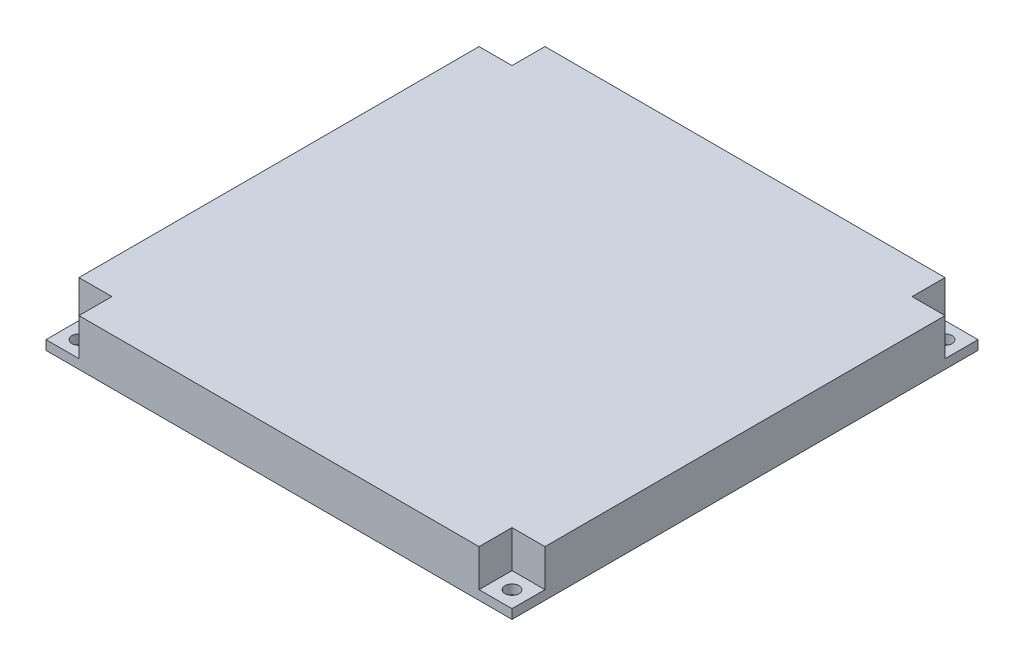
ISO-10303-21;
HEADER;
FILE_DESCRIPTION(('STEP AP214'),'2;1');
FILE_NAME('part.step','',(''),(''),'','','');
FILE_SCHEMA(('AUTOMOTIVE_DESIGN { 1 0 10303 214 1 1 1 1 }'));
ENDSEC;
DATA;
#1=APPLICATION_CONTEXT('core data for automotive mechanical design processes');
#2=APPLICATION_PROTOCOL_DEFINITION('international standard','automotive_design',2000,#1);
#3=PRODUCT_CONTEXT('',#1,'mechanical');
#4=PRODUCT('Part','Part','',(#3));
#5=PRODUCT_RELATED_PRODUCT_CATEGORY('part','',(#4));
#6=PRODUCT_DEFINITION_FORMATION('','',#4);
#7=PRODUCT_DEFINITION_CONTEXT('part definition',#1,'design');
#8=PRODUCT_DEFINITION('design','',#6,#7);
#9=PRODUCT_DEFINITION_SHAPE('','',#8);
#10=(LENGTH_UNIT() NAMED_UNIT(*) SI_UNIT(.MILLI.,.METRE.));
#11=(NAMED_UNIT(*) PLANE_ANGLE_UNIT() SI_UNIT($,.RADIAN.));
#12=(NAMED_UNIT(*) SI_UNIT($,.STERADIAN.) SOLID_ANGLE_UNIT());
#13=UNCERTAINTY_MEASURE_WITH_UNIT(LENGTH_MEASURE(1.E-05),#10,'distance_accuracy_value','');
#14=(GEOMETRIC_REPRESENTATION_CONTEXT(3) GLOBAL_UNCERTAINTY_ASSIGNED_CONTEXT((#13)) GLOBAL_UNIT_ASSIGNED_CONTEXT((#10,
#11,#12)) REPRESENTATION_CONTEXT('',''));
#15=CARTESIAN_POINT('',(0.,0.,0.));
#16=DIRECTION('',(0.,0.,1.));
#17=DIRECTION('',(1.,0.,0.));
#18=AXIS2_PLACEMENT_3D('',#15,#16,#17);
#19=CARTESIAN_POINT('',(-46.4644660940671,-20.,-46.4644660940674));
#20=DIRECTION('',(0.,1.,0.));
#21=DIRECTION('',(0.,0.,1.));
#22=AXIS2_PLACEMENT_3D('',#19,#20,#21);
#23=CYLINDRICAL_SURFACE('',#22,1.5);
#24=CARTESIAN_POINT('',(-46.4644660940671,0.,-46.4644660940674));
#25=DIRECTION('',(0.,1.,0.));
#26=DIRECTION('',(0.,0.,1.));
#27=AXIS2_PLACEMENT_3D('',#24,#25,#26);
#28=CIRCLE('',#27,1.5);
#29=CARTESIAN_POINT('',(-46.4644660940671,0.,-44.9644660940674));
#30=VERTEX_POINT('',#29);
#31=EDGE_CURVE('E391',#30,#30,#28,.T.);
#32=ORIENTED_EDGE('',*,*,#31,.F.);
#33=EDGE_LOOP('',(#32));
#34=FACE_BOUND('',#33,.T.);
#35=CARTESIAN_POINT('',(-46.4644660940671,2.,-46.4644660940674));
#36=DIRECTION('',(0.,1.,0.));
#37=DIRECTION('',(0.,0.,1.));
#38=AXIS2_PLACEMENT_3D('',#35,#36,#37);
#39=CIRCLE('',#38,1.5);
#40=CARTESIAN_POINT('',(-46.4644660940671,2.,-44.9644660940674));
#41=VERTEX_POINT('',#40);
#42=EDGE_CURVE('E403',#41,#41,#39,.F.);
#43=ORIENTED_EDGE('',*,*,#42,.F.);
#44=EDGE_LOOP('',(#43));
#45=FACE_BOUND('',#44,.T.);
#46=ADVANCED_FACE('F42',(#34,#45),#23,.F.);
#47=CARTESIAN_POINT('',(46.4644660940676,-20.,-46.4644660940669));
#48=DIRECTION('',(0.,1.,0.));
#49=DIRECTION('',(0.,0.,1.));
#50=AXIS2_PLACEMENT_3D('',#47,#48,#49);
#51=CYLINDRICAL_SURFACE('',#50,1.50000000000001);
#52=CARTESIAN_POINT('',(46.4644660940676,0.,-46.4644660940669));
#53=DIRECTION('',(0.,1.,0.));
#54=DIRECTION('',(0.,0.,1.));
#55=AXIS2_PLACEMENT_3D('',#52,#53,#54);
#56=CIRCLE('',#55,1.50000000000001);
#57=CARTESIAN_POINT('',(46.4644660940676,0.,-44.9644660940669));
#58=VERTEX_POINT('',#57);
#59=EDGE_CURVE('E394',#58,#58,#56,.T.);
#60=ORIENTED_EDGE('',*,*,#59,.F.);
#61=EDGE_LOOP('',(#60));
#62=FACE_BOUND('',#61,.T.);
#63=CARTESIAN_POINT('',(46.4644660940676,2.,-46.4644660940669));
#64=DIRECTION('',(0.,1.,0.));
#65=DIRECTION('',(0.,0.,1.));
#66=AXIS2_PLACEMENT_3D('',#63,#64,#65);
#67=CIRCLE('',#66,1.50000000000001);
#68=CARTESIAN_POINT('',(46.4644660940676,2.,-44.9644660940669));
#69=VERTEX_POINT('',#68);
#70=EDGE_CURVE('E401',#69,#69,#67,.F.);
#71=ORIENTED_EDGE('',*,*,#70,.F.);
#72=EDGE_LOOP('',(#71));
#73=FACE_BOUND('',#72,.T.);
#74=ADVANCED_FACE('F431',(#62,#73),#51,.F.);
#75=CARTESIAN_POINT('',(46.4644660940668,-20.,46.4644660940677));
#76=DIRECTION('',(0.,1.,0.));
#77=DIRECTION('',(0.,0.,1.));
#78=AXIS2_PLACEMENT_3D('',#75,#76,#77);
#79=CYLINDRICAL_SURFACE('',#78,1.50000000000001);
#80=CARTESIAN_POINT('',(46.4644660940668,0.,46.4644660940677));
#81=DIRECTION('',(0.,1.,0.));
#82=DIRECTION('',(0.,0.,1.));
#83=AXIS2_PLACEMENT_3D('',#80,#81,#82);
#84=CIRCLE('',#83,1.50000000000001);
#85=CARTESIAN_POINT('',(46.4644660940668,0.,47.9644660940677));
#86=VERTEX_POINT('',#85);
#87=EDGE_CURVE('E376',#86,#86,#84,.T.);
#88=ORIENTED_EDGE('',*,*,#87,.F.);
#89=EDGE_LOOP('',(#88));
#90=FACE_BOUND('',#89,.T.);
#91=CARTESIAN_POINT('',(46.4644660940668,2.,46.4644660940677));
#92=DIRECTION('',(0.,1.,0.));
#93=DIRECTION('',(0.,0.,1.));
#94=AXIS2_PLACEMENT_3D('',#91,#92,#93);
#95=CIRCLE('',#94,1.50000000000001);
#96=CARTESIAN_POINT('',(46.4644660940668,2.,47.9644660940677));
#97=VERTEX_POINT('',#96);
#98=EDGE_CURVE('E354',#97,#97,#95,.F.);
#99=ORIENTED_EDGE('',*,*,#98,.F.);
#100=EDGE_LOOP('',(#99));
#101=FACE_BOUND('',#100,.T.);
#102=ADVANCED_FACE('F437',(#90,#101),#79,.F.);
#103=CARTESIAN_POINT('',(50.,10.,-50.));
#104=DIRECTION('',(-1.,0.,0.));
#105=DIRECTION('',(0.,0.,1.));
#106=AXIS2_PLACEMENT_3D('',#103,#104,#105);
#107=PLANE('',#106);
#108=DIRECTION('',(0.,0.,-1.));
#109=VECTOR('',#108,1.);
#110=CARTESIAN_POINT('',(50.,10.,-50.));
#111=LINE('',#110,#109);
#112=CARTESIAN_POINT('',(50.,10.,42.928932188135));
#113=VERTEX_POINT('',#112);
#114=CARTESIAN_POINT('',(50.0000000000003,10.,-42.9289321881342));
#115=VERTEX_POINT('',#114);
#116=EDGE_CURVE('E358',#113,#115,#111,.T.);
#117=ORIENTED_EDGE('',*,*,#116,.F.);
#118=DIRECTION('',(0.,1.,0.));
#119=VECTOR('',#118,1.);
#120=CARTESIAN_POINT('',(49.9999999999995,2.,42.928932188135));
#121=LINE('',#120,#119);
#122=CARTESIAN_POINT('',(49.9999999999995,2.,42.928932188135));
#123=VERTEX_POINT('',#122);
#124=EDGE_CURVE('E316',#123,#113,#121,.T.);
#125=ORIENTED_EDGE('',*,*,#124,.F.);
#126=DIRECTION('',(0.,0.,-1.));
#127=VECTOR('',#126,1.);
#128=CARTESIAN_POINT('',(49.9999999999995,2.,42.928932188135));
#129=LINE('',#128,#127);
#130=CARTESIAN_POINT('',(49.9999999999995,2.,50.0000000000005));
#131=VERTEX_POINT('',#130);
#132=EDGE_CURVE('E325',#131,#123,#129,.T.);
#133=ORIENTED_EDGE('',*,*,#132,.F.);
#134=DIRECTION('',(0.,-1.,0.));
#135=VECTOR('',#134,1.);
#136=CARTESIAN_POINT('',(50.,10.,50.));
#137=LINE('',#136,#135);
#138=CARTESIAN_POINT('',(50.,0.,50.));
#139=VERTEX_POINT('',#138);
#140=EDGE_CURVE('E371',#131,#139,#137,.T.);
#141=ORIENTED_EDGE('',*,*,#140,.T.);
#142=DIRECTION('',(0.,0.,-1.));
#143=VECTOR('',#142,1.);
#144=CARTESIAN_POINT('',(50.,0.,-50.));
#145=LINE('',#144,#143);
#146=CARTESIAN_POINT('',(50.,0.,-50.));
#147=VERTEX_POINT('',#146);
#148=EDGE_CURVE('E372',#139,#147,#145,.T.);
#149=ORIENTED_EDGE('',*,*,#148,.T.);
#150=DIRECTION('',(0.,-1.,0.));
#151=VECTOR('',#150,1.);
#152=CARTESIAN_POINT('',(50.,10.,-50.));
#153=LINE('',#152,#151);
#154=CARTESIAN_POINT('',(50.0000000000003,2.,-49.9999999999996));
#155=VERTEX_POINT('',#154);
#156=EDGE_CURVE('E11',#155,#147,#153,.T.);
#157=ORIENTED_EDGE('',*,*,#156,.F.);
#158=DIRECTION('',(0.,0.,-1.));
#159=VECTOR('',#158,1.);
#160=CARTESIAN_POINT('',(50.0000000000003,2.,-42.9289321881342));
#161=LINE('',#160,#159);
#162=CARTESIAN_POINT('',(50.0000000000003,2.,-42.9289321881342));
#163=VERTEX_POINT('',#162);
#164=EDGE_CURVE('E295',#163,#155,#161,.T.);
#165=ORIENTED_EDGE('',*,*,#164,.F.);
#166=DIRECTION('',(0.,1.,0.));
#167=VECTOR('',#166,1.);
#168=CARTESIAN_POINT('',(50.0000000000003,2.,-42.9289321881342));
#169=LINE('',#168,#167);
#170=EDGE_CURVE('E298',#163,#115,#169,.T.);
#171=ORIENTED_EDGE('',*,*,#170,.T.);
#172=EDGE_LOOP('',(#117,#125,#133,#141,#149,#157,#165,#171));
#173=FACE_BOUND('',#172,.T.);
#174=ADVANCED_FACE('F44',(#173),#107,.F.);
#175=CARTESIAN_POINT('',(-50.,10.,-50.));
#176=DIRECTION('',(0.,0.,1.));
#177=DIRECTION('',(1.,0.,0.));
#178=AXIS2_PLACEMENT_3D('',#175,#176,#177);
#179=PLANE('',#178);
#180=DIRECTION('',(-1.,0.,0.));
#181=VECTOR('',#180,1.);
#182=CARTESIAN_POINT('',(-50.,10.,-50.));
#183=LINE('',#182,#181);
#184=CARTESIAN_POINT('',(42.9289321881348,10.,-50.));
#185=VERTEX_POINT('',#184);
#186=CARTESIAN_POINT('',(-42.9289321881343,10.,-50.0000000000001));
#187=VERTEX_POINT('',#186);
#188=EDGE_CURVE('E361',#185,#187,#183,.T.);
#189=ORIENTED_EDGE('',*,*,#188,.F.);
#190=DIRECTION('',(0.,1.,0.));
#191=VECTOR('',#190,1.);
#192=CARTESIAN_POINT('',(42.9289321881348,2.,-49.9999999999997));
#193=LINE('',#192,#191);
#194=CARTESIAN_POINT('',(42.9289321881348,2.,-49.9999999999997));
#195=VERTEX_POINT('',#194);
#196=EDGE_CURVE('E293',#195,#185,#193,.T.);
#197=ORIENTED_EDGE('',*,*,#196,.F.);
#198=DIRECTION('',(-1.,0.,0.));
#199=VECTOR('',#198,1.);
#200=CARTESIAN_POINT('',(42.9289321881348,2.,-49.9999999999997));
#201=LINE('',#200,#199);
#202=EDGE_CURVE('E304',#155,#195,#201,.T.);
#203=ORIENTED_EDGE('',*,*,#202,.F.);
#204=ORIENTED_EDGE('',*,*,#156,.T.);
#205=DIRECTION('',(-1.,0.,0.));
#206=VECTOR('',#205,1.);
#207=CARTESIAN_POINT('',(-50.,0.,-50.));
#208=LINE('',#207,#206);
#209=CARTESIAN_POINT('',(-50.,0.,-50.));
#210=VERTEX_POINT('',#209);
#211=EDGE_CURVE('E375',#147,#210,#208,.T.);
#212=ORIENTED_EDGE('',*,*,#211,.T.);
#213=DIRECTION('',(0.,-1.,0.));
#214=VECTOR('',#213,1.);
#215=CARTESIAN_POINT('',(-50.,10.,-50.));
#216=LINE('',#215,#214);
#217=CARTESIAN_POINT('',(-49.9999999999998,2.,-50.0000000000002));
#218=VERTEX_POINT('',#217);
#219=EDGE_CURVE('E51',#218,#210,#216,.T.);
#220=ORIENTED_EDGE('',*,*,#219,.F.);
#221=DIRECTION('',(-1.,0.,0.));
#222=VECTOR('',#221,1.);
#223=CARTESIAN_POINT('',(-42.9289321881343,2.,-50.0000000000001));
#224=LINE('',#223,#222);
#225=CARTESIAN_POINT('',(-42.9289321881343,2.,-50.0000000000001));
#226=VERTEX_POINT('',#225);
#227=EDGE_CURVE('E270',#226,#218,#224,.T.);
#228=ORIENTED_EDGE('',*,*,#227,.F.);
#229=DIRECTION('',(0.,1.,0.));
#230=VECTOR('',#229,1.);
#231=CARTESIAN_POINT('',(-42.9289321881343,2.,-50.0000000000001));
#232=LINE('',#231,#230);
#233=EDGE_CURVE('E273',#226,#187,#232,.T.);
#234=ORIENTED_EDGE('',*,*,#233,.T.);
#235=EDGE_LOOP('',(#189,#197,#203,#204,#212,#220,#228,#234));
#236=FACE_BOUND('',#235,.T.);
#237=ADVANCED_FACE('F462',(#236),#179,.F.);
#238=CARTESIAN_POINT('',(-50.,10.,-50.));
#239=DIRECTION('',(1.,0.,0.));
#240=DIRECTION('',(0.,0.,-1.));
#241=AXIS2_PLACEMENT_3D('',#238,#239,#240);
#242=PLANE('',#241);
#243=DIRECTION('',(0.,0.,1.));
#244=VECTOR('',#243,1.);
#245=CARTESIAN_POINT('',(-50.,10.,-50.));
#246=LINE('',#245,#244);
#247=CARTESIAN_POINT('',(-50.,10.,-42.9289321881347));
#248=VERTEX_POINT('',#247);
#249=CARTESIAN_POINT('',(-50.,10.,42.9289321881345));
#250=VERTEX_POINT('',#249);
#251=EDGE_CURVE('E365',#248,#250,#246,.T.);
#252=ORIENTED_EDGE('',*,*,#251,.F.);
#253=DIRECTION('',(0.,1.,0.));
#254=VECTOR('',#253,1.);
#255=CARTESIAN_POINT('',(-49.9999999999998,2.,-42.9289321881347));
#256=LINE('',#255,#254);
#257=CARTESIAN_POINT('',(-49.9999999999998,2.,-42.9289321881347));
#258=VERTEX_POINT('',#257);
#259=EDGE_CURVE('E268',#258,#248,#256,.T.);
#260=ORIENTED_EDGE('',*,*,#259,.F.);
#261=DIRECTION('',(0.,0.,1.));
#262=VECTOR('',#261,1.);
#263=CARTESIAN_POINT('',(-49.9999999999998,2.,-42.9289321881347));
#264=LINE('',#263,#262);
#265=EDGE_CURVE('E280',#218,#258,#264,.T.);
#266=ORIENTED_EDGE('',*,*,#265,.F.);
#267=ORIENTED_EDGE('',*,*,#219,.T.);
#268=DIRECTION('',(0.,0.,1.));
#269=VECTOR('',#268,1.);
#270=CARTESIAN_POINT('',(-50.,0.,-50.));
#271=LINE('',#270,#269);
#272=CARTESIAN_POINT('',(-50.,0.,50.));
#273=VERTEX_POINT('',#272);
#274=EDGE_CURVE('E379',#210,#273,#271,.T.);
#275=ORIENTED_EDGE('',*,*,#274,.T.);
#276=DIRECTION('',(0.,-1.,0.));
#277=VECTOR('',#276,1.);
#278=CARTESIAN_POINT('',(-50.,10.,50.));
#279=LINE('',#278,#277);
#280=CARTESIAN_POINT('',(-50.,2.,50.));
#281=VERTEX_POINT('',#280);
#282=EDGE_CURVE('E385',#281,#273,#279,.T.);
#283=ORIENTED_EDGE('',*,*,#282,.F.);
#284=DIRECTION('',(0.,0.,1.));
#285=VECTOR('',#284,1.);
#286=CARTESIAN_POINT('',(-50.,2.,42.9289321881345));
#287=LINE('',#286,#285);
#288=CARTESIAN_POINT('',(-50.,2.,42.9289321881345));
#289=VERTEX_POINT('',#288);
#290=EDGE_CURVE('E337',#289,#281,#287,.T.);
#291=ORIENTED_EDGE('',*,*,#290,.F.);
#292=DIRECTION('',(0.,1.,0.));
#293=VECTOR('',#292,1.);
#294=CARTESIAN_POINT('',(-50.,2.,42.9289321881345));
#295=LINE('',#294,#293);
#296=EDGE_CURVE('E351',#289,#250,#295,.T.);
#297=ORIENTED_EDGE('',*,*,#296,.T.);
#298=EDGE_LOOP('',(#252,#260,#266,#267,#275,#283,#291,#297));
#299=FACE_BOUND('',#298,.T.);
#300=ADVANCED_FACE('F459',(#299),#242,.F.);
#301=CARTESIAN_POINT('',(-50.,10.,50.));
#302=DIRECTION('',(0.,0.,-1.));
#303=DIRECTION('',(-1.,0.,0.));
#304=AXIS2_PLACEMENT_3D('',#301,#302,#303);
#305=PLANE('',#304);
#306=DIRECTION('',(1.,0.,0.));
#307=VECTOR('',#306,1.);
#308=CARTESIAN_POINT('',(42.928932188134,2.,50.0000000000004));
#309=LINE('',#308,#307);
#310=CARTESIAN_POINT('',(42.928932188134,2.,50.0000000000004));
#311=VERTEX_POINT('',#310);
#312=EDGE_CURVE('E318',#311,#131,#309,.T.);
#313=ORIENTED_EDGE('',*,*,#312,.F.);
#314=DIRECTION('',(0.,1.,0.));
#315=VECTOR('',#314,1.);
#316=CARTESIAN_POINT('',(42.928932188134,2.,50.0000000000004));
#317=LINE('',#316,#315);
#318=CARTESIAN_POINT('',(42.928932188134,10.,50.0000000000004));
#319=VERTEX_POINT('',#318);
#320=EDGE_CURVE('E267',#311,#319,#317,.T.);
#321=ORIENTED_EDGE('',*,*,#320,.T.);
#322=DIRECTION('',(1.,0.,0.));
#323=VECTOR('',#322,1.);
#324=CARTESIAN_POINT('',(-50.,10.,50.));
#325=LINE('',#324,#323);
#326=CARTESIAN_POINT('',(-42.9289321881345,10.,50.));
#327=VERTEX_POINT('',#326);
#328=EDGE_CURVE('E368',#327,#319,#325,.T.);
#329=ORIENTED_EDGE('',*,*,#328,.F.);
#330=DIRECTION('',(0.,1.,0.));
#331=VECTOR('',#330,1.);
#332=CARTESIAN_POINT('',(-42.9289321881345,2.,50.));
#333=LINE('',#332,#331);
#334=CARTESIAN_POINT('',(-42.9289321881345,2.,50.));
#335=VERTEX_POINT('',#334);
#336=EDGE_CURVE('E67',#335,#327,#333,.T.);
#337=ORIENTED_EDGE('',*,*,#336,.F.);
#338=DIRECTION('',(1.,0.,0.));
#339=VECTOR('',#338,1.);
#340=CARTESIAN_POINT('',(-42.9289321881345,2.,50.));
#341=LINE('',#340,#339);
#342=EDGE_CURVE('E339',#281,#335,#341,.T.);
#343=ORIENTED_EDGE('',*,*,#342,.F.);
#344=ORIENTED_EDGE('',*,*,#282,.T.);
#345=DIRECTION('',(1.,0.,0.));
#346=VECTOR('',#345,1.);
#347=CARTESIAN_POINT('',(-50.,0.,50.));
#348=LINE('',#347,#346);
#349=EDGE_CURVE('E362',#273,#139,#348,.T.);
#350=ORIENTED_EDGE('',*,*,#349,.T.);
#351=ORIENTED_EDGE('',*,*,#140,.F.);
#352=EDGE_LOOP('',(#313,#321,#329,#337,#343,#344,#350,#351));
#353=FACE_BOUND('',#352,.T.);
#354=ADVANCED_FACE('F453',(#353),#305,.F.);
#355=CARTESIAN_POINT('',(0.,10.,0.));
#356=DIRECTION('',(0.,1.,0.));
#357=DIRECTION('',(0.,0.,1.));
#358=AXIS2_PLACEMENT_3D('',#355,#356,#357);
#359=PLANE('',#358);
#360=DIRECTION('',(0.,0.,1.));
#361=VECTOR('',#360,1.);
#362=CARTESIAN_POINT('',(42.9289321881341,10.,42.928932188135));
#363=LINE('',#362,#361);
#364=CARTESIAN_POINT('',(42.9289321881341,10.,42.928932188135));
#365=VERTEX_POINT('',#364);
#366=EDGE_CURVE('E323',#365,#319,#363,.T.);
#367=ORIENTED_EDGE('',*,*,#366,.F.);
#368=DIRECTION('',(-1.,0.,0.));
#369=VECTOR('',#368,1.);
#370=CARTESIAN_POINT('',(42.9289321881341,10.,42.928932188135));
#371=LINE('',#370,#369);
#372=EDGE_CURVE('E301',#113,#365,#371,.T.);
#373=ORIENTED_EDGE('',*,*,#372,.F.);
#374=ORIENTED_EDGE('',*,*,#116,.T.);
#375=DIRECTION('',(1.,0.,0.));
#376=VECTOR('',#375,1.);
#377=CARTESIAN_POINT('',(42.9289321881348,10.,-42.9289321881342));
#378=LINE('',#377,#376);
#379=CARTESIAN_POINT('',(42.9289321881348,10.,-42.9289321881342));
#380=VERTEX_POINT('',#379);
#381=EDGE_CURVE('E302',#380,#115,#378,.T.);
#382=ORIENTED_EDGE('',*,*,#381,.F.);
#383=DIRECTION('',(0.,0.,1.));
#384=VECTOR('',#383,1.);
#385=CARTESIAN_POINT('',(42.9289321881348,10.,-42.9289321881342));
#386=LINE('',#385,#384);
#387=EDGE_CURVE('E276',#185,#380,#386,.T.);
#388=ORIENTED_EDGE('',*,*,#387,.F.);
#389=ORIENTED_EDGE('',*,*,#188,.T.);
#390=DIRECTION('',(0.,0.,-1.));
#391=VECTOR('',#390,1.);
#392=CARTESIAN_POINT('',(-42.9289321881344,10.,-42.9289321881347));
#393=LINE('',#392,#391);
#394=CARTESIAN_POINT('',(-42.9289321881344,10.,-42.9289321881347));
#395=VERTEX_POINT('',#394);
#396=EDGE_CURVE('E277',#395,#187,#393,.T.);
#397=ORIENTED_EDGE('',*,*,#396,.F.);
#398=DIRECTION('',(1.,0.,0.));
#399=VECTOR('',#398,1.);
#400=CARTESIAN_POINT('',(-42.9289321881344,10.,-42.9289321881347));
#401=LINE('',#400,#399);
#402=EDGE_CURVE('E279',#248,#395,#401,.T.);
#403=ORIENTED_EDGE('',*,*,#402,.F.);
#404=ORIENTED_EDGE('',*,*,#251,.T.);
#405=DIRECTION('',(-1.,0.,0.));
#406=VECTOR('',#405,1.);
#407=CARTESIAN_POINT('',(-42.9289321881345,10.,42.9289321881345));
#408=LINE('',#407,#406);
#409=CARTESIAN_POINT('',(-42.9289321881345,10.,42.9289321881345));
#410=VERTEX_POINT('',#409);
#411=EDGE_CURVE('E340',#410,#250,#408,.T.);
#412=ORIENTED_EDGE('',*,*,#411,.F.);
#413=DIRECTION('',(0.,0.,-1.));
#414=VECTOR('',#413,1.);
#415=CARTESIAN_POINT('',(-42.9289321881345,10.,42.9289321881345));
#416=LINE('',#415,#414);
#417=EDGE_CURVE('E283',#327,#410,#416,.T.);
#418=ORIENTED_EDGE('',*,*,#417,.F.);
#419=ORIENTED_EDGE('',*,*,#328,.T.);
#420=EDGE_LOOP('',(#367,#373,#374,#382,#388,#389,#397,#403,#404,#412,#418,#419));
#421=FACE_BOUND('',#420,.T.);
#422=ADVANCED_FACE('F450',(#421),#359,.T.);
#423=CARTESIAN_POINT('',(0.,0.,0.));
#424=DIRECTION('',(0.,1.,0.));
#425=DIRECTION('',(0.,0.,1.));
#426=AXIS2_PLACEMENT_3D('',#423,#424,#425);
#427=PLANE('',#426);
#428=DIRECTION('',(0.,0.,1.));
#429=VECTOR('',#428,1.);
#430=CARTESIAN_POINT('',(40.9289321881345,0.,2.81147158996242E-13));
#431=LINE('',#430,#429);
#432=CARTESIAN_POINT('',(40.9289321881348,0.,-48.));
#433=VERTEX_POINT('',#432);
#434=CARTESIAN_POINT('',(40.9289321881348,0.,-40.9289321881342));
#435=VERTEX_POINT('',#434);
#436=EDGE_CURVE('E259',#433,#435,#431,.T.);
#437=ORIENTED_EDGE('',*,*,#436,.F.);
#438=DIRECTION('',(-1.,0.,0.));
#439=VECTOR('',#438,1.);
#440=CARTESIAN_POINT('',(-50.,0.,-48.));
#441=LINE('',#440,#439);
#442=CARTESIAN_POINT('',(-40.9289321881343,0.,-48.));
#443=VERTEX_POINT('',#442);
#444=EDGE_CURVE('E241',#433,#443,#441,.T.);
#445=ORIENTED_EDGE('',*,*,#444,.T.);
#446=DIRECTION('',(0.,0.,-1.));
#447=VECTOR('',#446,1.);
#448=CARTESIAN_POINT('',(-40.9289321881345,0.,-1.20491639569818E-13));
#449=LINE('',#448,#447);
#450=CARTESIAN_POINT('',(-40.9289321881344,0.,-40.9289321881346));
#451=VERTEX_POINT('',#450);
#452=EDGE_CURVE('E250',#451,#443,#449,.T.);
#453=ORIENTED_EDGE('',*,*,#452,.F.);
#454=DIRECTION('',(1.,0.,0.));
#455=VECTOR('',#454,1.);
#456=CARTESIAN_POINT('',(1.20491639569818E-13,0.,-40.9289321881345));
#457=LINE('',#456,#455);
#458=CARTESIAN_POINT('',(-48.,0.,-40.9289321881347));
#459=VERTEX_POINT('',#458);
#460=EDGE_CURVE('E245',#459,#451,#457,.T.);
#461=ORIENTED_EDGE('',*,*,#460,.F.);
#462=DIRECTION('',(0.,0.,1.));
#463=VECTOR('',#462,1.);
#464=CARTESIAN_POINT('',(-48.,0.,-50.));
#465=LINE('',#464,#463);
#466=CARTESIAN_POINT('',(-48.,0.,40.9289321881345));
#467=VERTEX_POINT('',#466);
#468=EDGE_CURVE('E229',#459,#467,#465,.T.);
#469=ORIENTED_EDGE('',*,*,#468,.T.);
#470=DIRECTION('',(-1.,0.,0.));
#471=VECTOR('',#470,1.);
#472=CARTESIAN_POINT('',(-42.9289321881345,0.,40.9289321881345));
#473=LINE('',#472,#471);
#474=CARTESIAN_POINT('',(-40.9289321881345,0.,40.9289321881345));
#475=VERTEX_POINT('',#474);
#476=EDGE_CURVE('E877',#475,#467,#473,.T.);
#477=ORIENTED_EDGE('',*,*,#476,.F.);
#478=DIRECTION('',(0.,0.,-1.));
#479=VECTOR('',#478,1.);
#480=CARTESIAN_POINT('',(-40.9289321881345,0.,42.9289321881345));
#481=LINE('',#480,#479);
#482=CARTESIAN_POINT('',(-40.9289321881345,0.,48.));
#483=VERTEX_POINT('',#482);
#484=EDGE_CURVE('E880',#483,#475,#481,.T.);
#485=ORIENTED_EDGE('',*,*,#484,.F.);
#486=DIRECTION('',(1.,0.,0.));
#487=VECTOR('',#486,1.);
#488=CARTESIAN_POINT('',(-50.,0.,48.));
#489=LINE('',#488,#487);
#490=CARTESIAN_POINT('',(40.928932188134,0.,48.));
#491=VERTEX_POINT('',#490);
#492=EDGE_CURVE('E240',#483,#491,#489,.T.);
#493=ORIENTED_EDGE('',*,*,#492,.T.);
#494=DIRECTION('',(0.,0.,1.));
#495=VECTOR('',#494,1.);
#496=CARTESIAN_POINT('',(40.9289321881345,0.,4.01638798566059E-13));
#497=LINE('',#496,#495);
#498=CARTESIAN_POINT('',(40.9289321881341,0.,40.9289321881349));
#499=VERTEX_POINT('',#498);
#500=EDGE_CURVE('E904',#499,#491,#497,.T.);
#501=ORIENTED_EDGE('',*,*,#500,.F.);
#502=DIRECTION('',(-1.,0.,0.));
#503=VECTOR('',#502,1.);
#504=CARTESIAN_POINT('',(-4.0163879856606E-13,0.,40.9289321881345));
#505=LINE('',#504,#503);
#506=CARTESIAN_POINT('',(48.,0.,40.928932188135));
#507=VERTEX_POINT('',#506);
#508=EDGE_CURVE('E890',#507,#499,#505,.T.);
#509=ORIENTED_EDGE('',*,*,#508,.F.);
#510=DIRECTION('',(0.,0.,-1.));
#511=VECTOR('',#510,1.);
#512=CARTESIAN_POINT('',(48.,0.,-50.));
#513=LINE('',#512,#511);
#514=CARTESIAN_POINT('',(48.,0.,-40.9289321881342));
#515=VERTEX_POINT('',#514);
#516=EDGE_CURVE('E887',#507,#515,#513,.T.);
#517=ORIENTED_EDGE('',*,*,#516,.T.);
#518=DIRECTION('',(1.,0.,0.));
#519=VECTOR('',#518,1.);
#520=CARTESIAN_POINT('',(2.81147158996241E-13,0.,-40.9289321881345));
#521=LINE('',#520,#519);
#522=EDGE_CURVE('E256',#435,#515,#521,.T.);
#523=ORIENTED_EDGE('',*,*,#522,.F.);
#524=EDGE_LOOP('',(#437,#445,#453,#461,#469,#477,#485,#493,#501,#509,#517,#523));
#525=FACE_BOUND('',#524,.T.);
#526=ORIENTED_EDGE('',*,*,#87,.T.);
#527=EDGE_LOOP('',(#526));
#528=FACE_BOUND('',#527,.T.);
#529=ORIENTED_EDGE('',*,*,#59,.T.);
#530=EDGE_LOOP('',(#529));
#531=FACE_BOUND('',#530,.T.);
#532=ORIENTED_EDGE('',*,*,#31,.T.);
#533=EDGE_LOOP('',(#532));
#534=FACE_BOUND('',#533,.T.);
#535=CARTESIAN_POINT('',(-46.4644660940672,0.,46.4644660940673));
#536=DIRECTION('',(0.,1.,0.));
#537=DIRECTION('',(0.,0.,1.));
#538=AXIS2_PLACEMENT_3D('',#535,#536,#537);
#539=CIRCLE('',#538,1.5);
#540=CARTESIAN_POINT('',(-46.4644660940672,0.,47.9644660940673));
#541=VERTEX_POINT('',#540);
#542=EDGE_CURVE('E388',#541,#541,#539,.T.);
#543=ORIENTED_EDGE('',*,*,#542,.T.);
#544=EDGE_LOOP('',(#543));
#545=FACE_BOUND('',#544,.T.);
#546=ORIENTED_EDGE('',*,*,#148,.F.);
#547=ORIENTED_EDGE('',*,*,#349,.F.);
#548=ORIENTED_EDGE('',*,*,#274,.F.);
#549=ORIENTED_EDGE('',*,*,#211,.F.);
#550=EDGE_LOOP('',(#546,#547,#548,#549));
#551=FACE_BOUND('',#550,.T.);
#552=ADVANCED_FACE('F253',(#525,#528,#531,#534,#545,#551),#427,.F.);
#553=CARTESIAN_POINT('',(-46.4644660940672,-20.,46.4644660940673));
#554=DIRECTION('',(0.,1.,0.));
#555=DIRECTION('',(0.,0.,1.));
#556=AXIS2_PLACEMENT_3D('',#553,#554,#555);
#557=CYLINDRICAL_SURFACE('',#556,1.5);
#558=CARTESIAN_POINT('',(-46.4644660940672,2.,46.4644660940673));
#559=DIRECTION('',(0.,-1.,0.));
#560=DIRECTION('',(0.,0.,-1.));
#561=AXIS2_PLACEMENT_3D('',#558,#559,#560);
#562=CIRCLE('',#561,1.5);
#563=CARTESIAN_POINT('',(-46.4644660940672,2.,44.9644660940673));
#564=VERTEX_POINT('',#563);
#565=EDGE_CURVE('E46',#564,#564,#562,.F.);
#566=ORIENTED_EDGE('',*,*,#565,.T.);
#567=EDGE_LOOP('',(#566));
#568=FACE_BOUND('',#567,.T.);
#569=ORIENTED_EDGE('',*,*,#542,.F.);
#570=EDGE_LOOP('',(#569));
#571=FACE_BOUND('',#570,.T.);
#572=ADVANCED_FACE('F410',(#568,#571),#557,.F.);
#573=CARTESIAN_POINT('',(0.,2.,0.));
#574=DIRECTION('',(0.,1.,0.));
#575=DIRECTION('',(0.,0.,1.));
#576=AXIS2_PLACEMENT_3D('',#573,#574,#575);
#577=PLANE('',#576);
#578=ORIENTED_EDGE('',*,*,#132,.T.);
#579=DIRECTION('',(-1.,0.,0.));
#580=VECTOR('',#579,1.);
#581=CARTESIAN_POINT('',(42.9289321881341,2.,42.928932188135));
#582=LINE('',#581,#580);
#583=CARTESIAN_POINT('',(42.9289321881341,2.,42.928932188135));
#584=VERTEX_POINT('',#583);
#585=EDGE_CURVE('E332',#123,#584,#582,.T.);
#586=ORIENTED_EDGE('',*,*,#585,.T.);
#587=DIRECTION('',(0.,0.,1.));
#588=VECTOR('',#587,1.);
#589=CARTESIAN_POINT('',(42.9289321881341,2.,42.928932188135));
#590=LINE('',#589,#588);
#591=EDGE_CURVE('E329',#584,#311,#590,.T.);
#592=ORIENTED_EDGE('',*,*,#591,.T.);
#593=ORIENTED_EDGE('',*,*,#312,.T.);
#594=EDGE_LOOP('',(#578,#586,#592,#593));
#595=FACE_BOUND('',#594,.T.);
#596=ORIENTED_EDGE('',*,*,#98,.T.);
#597=EDGE_LOOP('',(#596));
#598=FACE_BOUND('',#597,.T.);
#599=ADVANCED_FACE('F449',(#595,#598),#577,.T.);
#600=CARTESIAN_POINT('',(42.9289321881341,2.,42.928932188135));
#601=DIRECTION('',(-1.,0.,0.));
#602=DIRECTION('',(0.,0.,1.));
#603=AXIS2_PLACEMENT_3D('',#600,#601,#602);
#604=PLANE('',#603);
#605=ORIENTED_EDGE('',*,*,#366,.T.);
#606=ORIENTED_EDGE('',*,*,#320,.F.);
#607=ORIENTED_EDGE('',*,*,#591,.F.);
#608=DIRECTION('',(0.,1.,0.));
#609=VECTOR('',#608,1.);
#610=CARTESIAN_POINT('',(42.9289321881341,2.,42.928932188135));
#611=LINE('',#610,#609);
#612=EDGE_CURVE('E319',#584,#365,#611,.T.);
#613=ORIENTED_EDGE('',*,*,#612,.T.);
#614=EDGE_LOOP('',(#605,#606,#607,#613));
#615=FACE_BOUND('',#614,.T.);
#616=ADVANCED_FACE('F512',(#615),#604,.F.);
#617=CARTESIAN_POINT('',(42.9289321881341,2.,42.928932188135));
#618=DIRECTION('',(0.,0.,-1.));
#619=DIRECTION('',(-1.,0.,0.));
#620=AXIS2_PLACEMENT_3D('',#617,#618,#619);
#621=PLANE('',#620);
#622=ORIENTED_EDGE('',*,*,#372,.T.);
#623=ORIENTED_EDGE('',*,*,#612,.F.);
#624=ORIENTED_EDGE('',*,*,#585,.F.);
#625=ORIENTED_EDGE('',*,*,#124,.T.);
#626=EDGE_LOOP('',(#622,#623,#624,#625));
#627=FACE_BOUND('',#626,.T.);
#628=ADVANCED_FACE('F517',(#627),#621,.F.);
#629=CARTESIAN_POINT('',(0.,2.,0.));
#630=DIRECTION('',(0.,1.,0.));
#631=DIRECTION('',(0.,0.,1.));
#632=AXIS2_PLACEMENT_3D('',#629,#630,#631);
#633=PLANE('',#632);
#634=ORIENTED_EDGE('',*,*,#202,.T.);
#635=DIRECTION('',(0.,0.,1.));
#636=VECTOR('',#635,1.);
#637=CARTESIAN_POINT('',(42.9289321881348,2.,-42.9289321881342));
#638=LINE('',#637,#636);
#639=CARTESIAN_POINT('',(42.9289321881348,2.,-42.9289321881342));
#640=VERTEX_POINT('',#639);
#641=EDGE_CURVE('E311',#195,#640,#638,.T.);
#642=ORIENTED_EDGE('',*,*,#641,.T.);
#643=DIRECTION('',(1.,0.,0.));
#644=VECTOR('',#643,1.);
#645=CARTESIAN_POINT('',(42.9289321881348,2.,-42.9289321881342));
#646=LINE('',#645,#644);
#647=EDGE_CURVE('E308',#640,#163,#646,.T.);
#648=ORIENTED_EDGE('',*,*,#647,.T.);
#649=ORIENTED_EDGE('',*,*,#164,.T.);
#650=EDGE_LOOP('',(#634,#642,#648,#649));
#651=FACE_BOUND('',#650,.T.);
#652=ORIENTED_EDGE('',*,*,#70,.T.);
#653=EDGE_LOOP('',(#652));
#654=FACE_BOUND('',#653,.T.);
#655=ADVANCED_FACE('F483',(#651,#654),#633,.T.);
#656=CARTESIAN_POINT('',(42.9289321881348,2.,-42.9289321881342));
#657=DIRECTION('',(0.,0.,1.));
#658=DIRECTION('',(1.,0.,0.));
#659=AXIS2_PLACEMENT_3D('',#656,#657,#658);
#660=PLANE('',#659);
#661=ORIENTED_EDGE('',*,*,#381,.T.);
#662=ORIENTED_EDGE('',*,*,#170,.F.);
#663=ORIENTED_EDGE('',*,*,#647,.F.);
#664=DIRECTION('',(0.,1.,0.));
#665=VECTOR('',#664,1.);
#666=CARTESIAN_POINT('',(42.9289321881348,2.,-42.9289321881342));
#667=LINE('',#666,#665);
#668=EDGE_CURVE('E296',#640,#380,#667,.T.);
#669=ORIENTED_EDGE('',*,*,#668,.T.);
#670=EDGE_LOOP('',(#661,#662,#663,#669));
#671=FACE_BOUND('',#670,.T.);
#672=ADVANCED_FACE('F520',(#671),#660,.F.);
#673=CARTESIAN_POINT('',(42.9289321881348,2.,-42.9289321881342));
#674=DIRECTION('',(-1.,0.,0.));
#675=DIRECTION('',(0.,0.,1.));
#676=AXIS2_PLACEMENT_3D('',#673,#674,#675);
#677=PLANE('',#676);
#678=ORIENTED_EDGE('',*,*,#387,.T.);
#679=ORIENTED_EDGE('',*,*,#668,.F.);
#680=ORIENTED_EDGE('',*,*,#641,.F.);
#681=ORIENTED_EDGE('',*,*,#196,.T.);
#682=EDGE_LOOP('',(#678,#679,#680,#681));
#683=FACE_BOUND('',#682,.T.);
#684=ADVANCED_FACE('F480',(#683),#677,.F.);
#685=CARTESIAN_POINT('',(0.,2.,0.));
#686=DIRECTION('',(0.,1.,0.));
#687=DIRECTION('',(0.,0.,1.));
#688=AXIS2_PLACEMENT_3D('',#685,#686,#687);
#689=PLANE('',#688);
#690=ORIENTED_EDGE('',*,*,#265,.T.);
#691=DIRECTION('',(1.,0.,0.));
#692=VECTOR('',#691,1.);
#693=CARTESIAN_POINT('',(-42.9289321881344,2.,-42.9289321881347));
#694=LINE('',#693,#692);
#695=CARTESIAN_POINT('',(-42.9289321881344,2.,-42.9289321881347));
#696=VERTEX_POINT('',#695);
#697=EDGE_CURVE('E288',#258,#696,#694,.T.);
#698=ORIENTED_EDGE('',*,*,#697,.T.);
#699=DIRECTION('',(0.,0.,-1.));
#700=VECTOR('',#699,1.);
#701=CARTESIAN_POINT('',(-42.9289321881344,2.,-42.9289321881347));
#702=LINE('',#701,#700);
#703=EDGE_CURVE('E285',#696,#226,#702,.T.);
#704=ORIENTED_EDGE('',*,*,#703,.T.);
#705=ORIENTED_EDGE('',*,*,#227,.T.);
#706=EDGE_LOOP('',(#690,#698,#704,#705));
#707=FACE_BOUND('',#706,.T.);
#708=ORIENTED_EDGE('',*,*,#42,.T.);
#709=EDGE_LOOP('',(#708));
#710=FACE_BOUND('',#709,.T.);
#711=ADVANCED_FACE('F501',(#707,#710),#689,.T.);
#712=CARTESIAN_POINT('',(-42.9289321881344,2.,-42.9289321881347));
#713=DIRECTION('',(1.,0.,0.));
#714=DIRECTION('',(0.,0.,-1.));
#715=AXIS2_PLACEMENT_3D('',#712,#713,#714);
#716=PLANE('',#715);
#717=ORIENTED_EDGE('',*,*,#396,.T.);
#718=ORIENTED_EDGE('',*,*,#233,.F.);
#719=ORIENTED_EDGE('',*,*,#703,.F.);
#720=DIRECTION('',(0.,1.,0.));
#721=VECTOR('',#720,1.);
#722=CARTESIAN_POINT('',(-42.9289321881344,2.,-42.9289321881347));
#723=LINE('',#722,#721);
#724=EDGE_CURVE('E271',#696,#395,#723,.T.);
#725=ORIENTED_EDGE('',*,*,#724,.T.);
#726=EDGE_LOOP('',(#717,#718,#719,#725));
#727=FACE_BOUND('',#726,.T.);
#728=ADVANCED_FACE('F426',(#727),#716,.F.);
#729=CARTESIAN_POINT('',(-42.9289321881344,2.,-42.9289321881347));
#730=DIRECTION('',(0.,0.,1.));
#731=DIRECTION('',(1.,0.,0.));
#732=AXIS2_PLACEMENT_3D('',#729,#730,#731);
#733=PLANE('',#732);
#734=ORIENTED_EDGE('',*,*,#402,.T.);
#735=ORIENTED_EDGE('',*,*,#724,.F.);
#736=ORIENTED_EDGE('',*,*,#697,.F.);
#737=ORIENTED_EDGE('',*,*,#259,.T.);
#738=EDGE_LOOP('',(#734,#735,#736,#737));
#739=FACE_BOUND('',#738,.T.);
#740=ADVANCED_FACE('F416',(#739),#733,.F.);
#741=CARTESIAN_POINT('',(0.,2.,0.));
#742=DIRECTION('',(0.,-1.,0.));
#743=DIRECTION('',(0.,0.,-1.));
#744=AXIS2_PLACEMENT_3D('',#741,#742,#743);
#745=PLANE('',#744);
#746=ORIENTED_EDGE('',*,*,#290,.T.);
#747=ORIENTED_EDGE('',*,*,#342,.T.);
#748=DIRECTION('',(0.,0.,-1.));
#749=VECTOR('',#748,1.);
#750=CARTESIAN_POINT('',(-42.9289321881345,2.,42.9289321881345));
#751=LINE('',#750,#749);
#752=CARTESIAN_POINT('',(-42.9289321881345,2.,42.9289321881345));
#753=VERTEX_POINT('',#752);
#754=EDGE_CURVE('E343',#335,#753,#751,.T.);
#755=ORIENTED_EDGE('',*,*,#754,.T.);
#756=DIRECTION('',(-1.,0.,0.));
#757=VECTOR('',#756,1.);
#758=CARTESIAN_POINT('',(-42.9289321881345,2.,42.9289321881345));
#759=LINE('',#758,#757);
#760=EDGE_CURVE('E346',#753,#289,#759,.T.);
#761=ORIENTED_EDGE('',*,*,#760,.T.);
#762=EDGE_LOOP('',(#746,#747,#755,#761));
#763=FACE_BOUND('',#762,.T.);
#764=ORIENTED_EDGE('',*,*,#565,.F.);
#765=EDGE_LOOP('',(#764));
#766=FACE_BOUND('',#765,.T.);
#767=ADVANCED_FACE('F413',(#763,#766),#745,.F.);
#768=CARTESIAN_POINT('',(-42.9289321881345,2.,42.9289321881345));
#769=DIRECTION('',(0.,0.,-1.));
#770=DIRECTION('',(-1.,0.,0.));
#771=AXIS2_PLACEMENT_3D('',#768,#769,#770);
#772=PLANE('',#771);
#773=ORIENTED_EDGE('',*,*,#411,.T.);
#774=ORIENTED_EDGE('',*,*,#296,.F.);
#775=ORIENTED_EDGE('',*,*,#760,.F.);
#776=DIRECTION('',(0.,1.,0.));
#777=VECTOR('',#776,1.);
#778=CARTESIAN_POINT('',(-42.9289321881345,2.,42.9289321881345));
#779=LINE('',#778,#777);
#780=EDGE_CURVE('E355',#753,#410,#779,.T.);
#781=ORIENTED_EDGE('',*,*,#780,.T.);
#782=EDGE_LOOP('',(#773,#774,#775,#781));
#783=FACE_BOUND('',#782,.T.);
#784=ADVANCED_FACE('F415',(#783),#772,.F.);
#785=CARTESIAN_POINT('',(-42.9289321881345,2.,42.9289321881345));
#786=DIRECTION('',(1.,0.,0.));
#787=DIRECTION('',(0.,0.,-1.));
#788=AXIS2_PLACEMENT_3D('',#785,#786,#787);
#789=PLANE('',#788);
#790=ORIENTED_EDGE('',*,*,#417,.T.);
#791=ORIENTED_EDGE('',*,*,#780,.F.);
#792=ORIENTED_EDGE('',*,*,#754,.F.);
#793=ORIENTED_EDGE('',*,*,#336,.T.);
#794=EDGE_LOOP('',(#790,#791,#792,#793));
#795=FACE_BOUND('',#794,.T.);
#796=ADVANCED_FACE('F423',(#795),#789,.F.);
#797=CARTESIAN_POINT('',(48.,10.,-50.));
#798=DIRECTION('',(-1.,0.,0.));
#799=DIRECTION('',(0.,0.,1.));
#800=AXIS2_PLACEMENT_3D('',#797,#798,#799);
#801=PLANE('',#800);
#802=DIRECTION('',(0.,0.,-1.));
#803=VECTOR('',#802,1.);
#804=CARTESIAN_POINT('',(48.,8.,-50.));
#805=LINE('',#804,#803);
#806=CARTESIAN_POINT('',(48.,8.,40.928932188135));
#807=VERTEX_POINT('',#806);
#808=CARTESIAN_POINT('',(48.,8.,-40.9289321881342));
#809=VERTEX_POINT('',#808);
#810=EDGE_CURVE('E916',#807,#809,#805,.T.);
#811=ORIENTED_EDGE('',*,*,#810,.T.);
#812=DIRECTION('',(0.,1.,0.));
#813=VECTOR('',#812,1.);
#814=CARTESIAN_POINT('',(48.,10.,-40.9289321881342));
#815=LINE('',#814,#813);
#816=EDGE_CURVE('E892',#515,#809,#815,.T.);
#817=ORIENTED_EDGE('',*,*,#816,.F.);
#818=ORIENTED_EDGE('',*,*,#516,.F.);
#819=DIRECTION('',(0.,1.,0.));
#820=VECTOR('',#819,1.);
#821=CARTESIAN_POINT('',(48.,2.,40.928932188135));
#822=LINE('',#821,#820);
#823=EDGE_CURVE('E906',#507,#807,#822,.T.);
#824=ORIENTED_EDGE('',*,*,#823,.T.);
#825=EDGE_LOOP('',(#811,#817,#818,#824));
#826=FACE_BOUND('',#825,.T.);
#827=ADVANCED_FACE('F609',(#826),#801,.T.);
#828=CARTESIAN_POINT('',(-50.,10.,-48.));
#829=DIRECTION('',(0.,0.,1.));
#830=DIRECTION('',(1.,0.,0.));
#831=AXIS2_PLACEMENT_3D('',#828,#829,#830);
#832=PLANE('',#831);
#833=DIRECTION('',(-1.,0.,0.));
#834=VECTOR('',#833,1.);
#835=CARTESIAN_POINT('',(-50.,8.,-48.));
#836=LINE('',#835,#834);
#837=CARTESIAN_POINT('',(40.9289321881348,8.,-48.));
#838=VERTEX_POINT('',#837);
#839=CARTESIAN_POINT('',(-40.9289321881343,8.,-48.));
#840=VERTEX_POINT('',#839);
#841=EDGE_CURVE('E884',#838,#840,#836,.T.);
#842=ORIENTED_EDGE('',*,*,#841,.T.);
#843=DIRECTION('',(0.,1.,0.));
#844=VECTOR('',#843,1.);
#845=CARTESIAN_POINT('',(-40.9289321881343,10.,-48.));
#846=LINE('',#845,#844);
#847=EDGE_CURVE('E899',#443,#840,#846,.T.);
#848=ORIENTED_EDGE('',*,*,#847,.F.);
#849=ORIENTED_EDGE('',*,*,#444,.F.);
#850=DIRECTION('',(0.,1.,0.));
#851=VECTOR('',#850,1.);
#852=CARTESIAN_POINT('',(40.9289321881348,2.,-48.));
#853=LINE('',#852,#851);
#854=EDGE_CURVE('E896',#433,#838,#853,.T.);
#855=ORIENTED_EDGE('',*,*,#854,.T.);
#856=EDGE_LOOP('',(#842,#848,#849,#855));
#857=FACE_BOUND('',#856,.T.);
#858=ADVANCED_FACE('F627',(#857),#832,.T.);
#859=CARTESIAN_POINT('',(-48.,10.,-50.));
#860=DIRECTION('',(1.,0.,0.));
#861=DIRECTION('',(0.,0.,-1.));
#862=AXIS2_PLACEMENT_3D('',#859,#860,#861);
#863=PLANE('',#862);
#864=DIRECTION('',(0.,0.,1.));
#865=VECTOR('',#864,1.);
#866=CARTESIAN_POINT('',(-48.,8.,-50.));
#867=LINE('',#866,#865);
#868=CARTESIAN_POINT('',(-48.,8.,-40.9289321881347));
#869=VERTEX_POINT('',#868);
#870=CARTESIAN_POINT('',(-48.,8.,40.9289321881345));
#871=VERTEX_POINT('',#870);
#872=EDGE_CURVE('E262',#869,#871,#867,.T.);
#873=ORIENTED_EDGE('',*,*,#872,.T.);
#874=DIRECTION('',(0.,1.,0.));
#875=VECTOR('',#874,1.);
#876=CARTESIAN_POINT('',(-48.,10.,40.9289321881345));
#877=LINE('',#876,#875);
#878=EDGE_CURVE('E236',#467,#871,#877,.T.);
#879=ORIENTED_EDGE('',*,*,#878,.F.);
#880=ORIENTED_EDGE('',*,*,#468,.F.);
#881=DIRECTION('',(0.,1.,0.));
#882=VECTOR('',#881,1.);
#883=CARTESIAN_POINT('',(-48.,2.,-40.9289321881347));
#884=LINE('',#883,#882);
#885=EDGE_CURVE('E233',#459,#869,#884,.T.);
#886=ORIENTED_EDGE('',*,*,#885,.T.);
#887=EDGE_LOOP('',(#873,#879,#880,#886));
#888=FACE_BOUND('',#887,.T.);
#889=ADVANCED_FACE('F232',(#888),#863,.T.);
#890=CARTESIAN_POINT('',(-50.,10.,48.));
#891=DIRECTION('',(0.,0.,-1.));
#892=DIRECTION('',(-1.,0.,0.));
#893=AXIS2_PLACEMENT_3D('',#890,#891,#892);
#894=PLANE('',#893);
#895=ORIENTED_EDGE('',*,*,#492,.F.);
#896=DIRECTION('',(0.,1.,0.));
#897=VECTOR('',#896,1.);
#898=CARTESIAN_POINT('',(-40.9289321881345,2.,48.));
#899=LINE('',#898,#897);
#900=CARTESIAN_POINT('',(-40.9289321881345,8.,48.));
#901=VERTEX_POINT('',#900);
#902=EDGE_CURVE('E863',#483,#901,#899,.T.);
#903=ORIENTED_EDGE('',*,*,#902,.T.);
#904=DIRECTION('',(1.,0.,0.));
#905=VECTOR('',#904,1.);
#906=CARTESIAN_POINT('',(-50.,8.,48.));
#907=LINE('',#906,#905);
#908=CARTESIAN_POINT('',(40.928932188134,8.,48.));
#909=VERTEX_POINT('',#908);
#910=EDGE_CURVE('E257',#901,#909,#907,.T.);
#911=ORIENTED_EDGE('',*,*,#910,.T.);
#912=DIRECTION('',(0.,1.,0.));
#913=VECTOR('',#912,1.);
#914=CARTESIAN_POINT('',(40.928932188134,10.,48.));
#915=LINE('',#914,#913);
#916=EDGE_CURVE('E875',#491,#909,#915,.T.);
#917=ORIENTED_EDGE('',*,*,#916,.F.);
#918=EDGE_LOOP('',(#895,#903,#911,#917));
#919=FACE_BOUND('',#918,.T.);
#920=ADVANCED_FACE('F648',(#919),#894,.T.);
#921=CARTESIAN_POINT('',(0.,8.,0.));
#922=DIRECTION('',(0.,1.,0.));
#923=DIRECTION('',(0.,0.,1.));
#924=AXIS2_PLACEMENT_3D('',#921,#922,#923);
#925=PLANE('',#924);
#926=DIRECTION('',(0.,0.,1.));
#927=VECTOR('',#926,1.);
#928=CARTESIAN_POINT('',(40.9289321881345,8.,4.01638798566059E-13));
#929=LINE('',#928,#927);
#930=CARTESIAN_POINT('',(40.9289321881341,8.,40.9289321881349));
#931=VERTEX_POINT('',#930);
#932=EDGE_CURVE('E872',#931,#909,#929,.T.);
#933=ORIENTED_EDGE('',*,*,#932,.T.);
#934=ORIENTED_EDGE('',*,*,#910,.F.);
#935=DIRECTION('',(0.,0.,-1.));
#936=VECTOR('',#935,1.);
#937=CARTESIAN_POINT('',(-40.9289321881345,8.,0.));
#938=LINE('',#937,#936);
#939=CARTESIAN_POINT('',(-40.9289321881345,8.,40.9289321881345));
#940=VERTEX_POINT('',#939);
#941=EDGE_CURVE('E861',#901,#940,#938,.T.);
#942=ORIENTED_EDGE('',*,*,#941,.T.);
#943=DIRECTION('',(-1.,0.,0.));
#944=VECTOR('',#943,1.);
#945=CARTESIAN_POINT('',(0.,8.,40.9289321881345));
#946=LINE('',#945,#944);
#947=EDGE_CURVE('E868',#940,#871,#946,.T.);
#948=ORIENTED_EDGE('',*,*,#947,.T.);
#949=ORIENTED_EDGE('',*,*,#872,.F.);
#950=DIRECTION('',(1.,0.,0.));
#951=VECTOR('',#950,1.);
#952=CARTESIAN_POINT('',(1.20491639569818E-13,8.,-40.9289321881345));
#953=LINE('',#952,#951);
#954=CARTESIAN_POINT('',(-40.9289321881344,8.,-40.9289321881346));
#955=VERTEX_POINT('',#954);
#956=EDGE_CURVE('E248',#869,#955,#953,.T.);
#957=ORIENTED_EDGE('',*,*,#956,.T.);
#958=DIRECTION('',(0.,0.,-1.));
#959=VECTOR('',#958,1.);
#960=CARTESIAN_POINT('',(-40.9289321881345,8.,-1.20491639569818E-13));
#961=LINE('',#960,#959);
#962=EDGE_CURVE('E900',#955,#840,#961,.T.);
#963=ORIENTED_EDGE('',*,*,#962,.T.);
#964=ORIENTED_EDGE('',*,*,#841,.F.);
#965=DIRECTION('',(0.,0.,1.));
#966=VECTOR('',#965,1.);
#967=CARTESIAN_POINT('',(40.9289321881345,8.,2.81147158996242E-13));
#968=LINE('',#967,#966);
#969=CARTESIAN_POINT('',(40.9289321881348,8.,-40.9289321881342));
#970=VERTEX_POINT('',#969);
#971=EDGE_CURVE('E895',#838,#970,#968,.T.);
#972=ORIENTED_EDGE('',*,*,#971,.T.);
#973=DIRECTION('',(1.,0.,0.));
#974=VECTOR('',#973,1.);
#975=CARTESIAN_POINT('',(2.81147158996241E-13,8.,-40.9289321881345));
#976=LINE('',#975,#974);
#977=EDGE_CURVE('E893',#970,#809,#976,.T.);
#978=ORIENTED_EDGE('',*,*,#977,.T.);
#979=ORIENTED_EDGE('',*,*,#810,.F.);
#980=DIRECTION('',(-1.,0.,0.));
#981=VECTOR('',#980,1.);
#982=CARTESIAN_POINT('',(-4.0163879856606E-13,8.,40.9289321881345));
#983=LINE('',#982,#981);
#984=EDGE_CURVE('E889',#807,#931,#983,.T.);
#985=ORIENTED_EDGE('',*,*,#984,.T.);
#986=EDGE_LOOP('',(#933,#934,#942,#948,#949,#957,#963,#964,#972,#978,#979,#985));
#987=FACE_BOUND('',#986,.T.);
#988=ADVANCED_FACE('F658',(#987),#925,.F.);
#989=CARTESIAN_POINT('',(40.9289321881341,2.,42.9289321881349));
#990=DIRECTION('',(-1.,0.,0.));
#991=DIRECTION('',(0.,0.,1.));
#992=AXIS2_PLACEMENT_3D('',#989,#990,#991);
#993=PLANE('',#992);
#994=ORIENTED_EDGE('',*,*,#932,.F.);
#995=DIRECTION('',(0.,1.,0.));
#996=VECTOR('',#995,1.);
#997=CARTESIAN_POINT('',(40.9289321881341,2.,40.9289321881349));
#998=LINE('',#997,#996);
#999=EDGE_CURVE('E907',#499,#931,#998,.T.);
#1000=ORIENTED_EDGE('',*,*,#999,.F.);
#1001=ORIENTED_EDGE('',*,*,#500,.T.);
#1002=ORIENTED_EDGE('',*,*,#916,.T.);
#1003=EDGE_LOOP('',(#994,#1000,#1001,#1002));
#1004=FACE_BOUND('',#1003,.T.);
#1005=ADVANCED_FACE('F669',(#1004),#993,.T.);
#1006=CARTESIAN_POINT('',(42.9289321881341,2.,40.9289321881349));
#1007=DIRECTION('',(0.,0.,-1.));
#1008=DIRECTION('',(-1.,0.,0.));
#1009=AXIS2_PLACEMENT_3D('',#1006,#1007,#1008);
#1010=PLANE('',#1009);
#1011=ORIENTED_EDGE('',*,*,#984,.F.);
#1012=ORIENTED_EDGE('',*,*,#823,.F.);
#1013=ORIENTED_EDGE('',*,*,#508,.T.);
#1014=ORIENTED_EDGE('',*,*,#999,.T.);
#1015=EDGE_LOOP('',(#1011,#1012,#1013,#1014));
#1016=FACE_BOUND('',#1015,.T.);
#1017=ADVANCED_FACE('F680',(#1016),#1010,.T.);
#1018=CARTESIAN_POINT('',(42.9289321881348,2.,-40.9289321881342));
#1019=DIRECTION('',(0.,0.,1.));
#1020=DIRECTION('',(1.,0.,0.));
#1021=AXIS2_PLACEMENT_3D('',#1018,#1019,#1020);
#1022=PLANE('',#1021);
#1023=ORIENTED_EDGE('',*,*,#977,.F.);
#1024=DIRECTION('',(0.,1.,0.));
#1025=VECTOR('',#1024,1.);
#1026=CARTESIAN_POINT('',(40.9289321881348,2.,-40.9289321881342));
#1027=LINE('',#1026,#1025);
#1028=EDGE_CURVE('E910',#435,#970,#1027,.T.);
#1029=ORIENTED_EDGE('',*,*,#1028,.F.);
#1030=ORIENTED_EDGE('',*,*,#522,.T.);
#1031=ORIENTED_EDGE('',*,*,#816,.T.);
#1032=EDGE_LOOP('',(#1023,#1029,#1030,#1031));
#1033=FACE_BOUND('',#1032,.T.);
#1034=ADVANCED_FACE('F691',(#1033),#1022,.T.);
#1035=CARTESIAN_POINT('',(40.9289321881348,2.,-42.9289321881342));
#1036=DIRECTION('',(-1.,0.,0.));
#1037=DIRECTION('',(0.,0.,1.));
#1038=AXIS2_PLACEMENT_3D('',#1035,#1036,#1037);
#1039=PLANE('',#1038);
#1040=ORIENTED_EDGE('',*,*,#971,.F.);
#1041=ORIENTED_EDGE('',*,*,#854,.F.);
#1042=ORIENTED_EDGE('',*,*,#436,.T.);
#1043=ORIENTED_EDGE('',*,*,#1028,.T.);
#1044=EDGE_LOOP('',(#1040,#1041,#1042,#1043));
#1045=FACE_BOUND('',#1044,.T.);
#1046=ADVANCED_FACE('F702',(#1045),#1039,.T.);
#1047=CARTESIAN_POINT('',(-40.9289321881344,2.,-42.9289321881347));
#1048=DIRECTION('',(1.,0.,0.));
#1049=DIRECTION('',(0.,0.,-1.));
#1050=AXIS2_PLACEMENT_3D('',#1047,#1048,#1049);
#1051=PLANE('',#1050);
#1052=ORIENTED_EDGE('',*,*,#962,.F.);
#1053=DIRECTION('',(0.,1.,0.));
#1054=VECTOR('',#1053,1.);
#1055=CARTESIAN_POINT('',(-40.9289321881344,2.,-40.9289321881346));
#1056=LINE('',#1055,#1054);
#1057=EDGE_CURVE('E59',#451,#955,#1056,.T.);
#1058=ORIENTED_EDGE('',*,*,#1057,.F.);
#1059=ORIENTED_EDGE('',*,*,#452,.T.);
#1060=ORIENTED_EDGE('',*,*,#847,.T.);
#1061=EDGE_LOOP('',(#1052,#1058,#1059,#1060));
#1062=FACE_BOUND('',#1061,.T.);
#1063=ADVANCED_FACE('F713',(#1062),#1051,.T.);
#1064=CARTESIAN_POINT('',(-42.9289321881344,2.,-40.9289321881347));
#1065=DIRECTION('',(0.,0.,1.));
#1066=DIRECTION('',(1.,0.,0.));
#1067=AXIS2_PLACEMENT_3D('',#1064,#1065,#1066);
#1068=PLANE('',#1067);
#1069=ORIENTED_EDGE('',*,*,#956,.F.);
#1070=ORIENTED_EDGE('',*,*,#885,.F.);
#1071=ORIENTED_EDGE('',*,*,#460,.T.);
#1072=ORIENTED_EDGE('',*,*,#1057,.T.);
#1073=EDGE_LOOP('',(#1069,#1070,#1071,#1072));
#1074=FACE_BOUND('',#1073,.T.);
#1075=ADVANCED_FACE('F244',(#1074),#1068,.T.);
#1076=CARTESIAN_POINT('',(-42.9289321881345,2.,40.9289321881345));
#1077=DIRECTION('',(0.,0.,-1.));
#1078=DIRECTION('',(-1.,0.,0.));
#1079=AXIS2_PLACEMENT_3D('',#1076,#1077,#1078);
#1080=PLANE('',#1079);
#1081=ORIENTED_EDGE('',*,*,#947,.F.);
#1082=DIRECTION('',(0.,1.,0.));
#1083=VECTOR('',#1082,1.);
#1084=CARTESIAN_POINT('',(-40.9289321881345,2.,40.9289321881345));
#1085=LINE('',#1084,#1083);
#1086=EDGE_CURVE('E866',#475,#940,#1085,.T.);
#1087=ORIENTED_EDGE('',*,*,#1086,.F.);
#1088=ORIENTED_EDGE('',*,*,#476,.T.);
#1089=ORIENTED_EDGE('',*,*,#878,.T.);
#1090=EDGE_LOOP('',(#1081,#1087,#1088,#1089));
#1091=FACE_BOUND('',#1090,.T.);
#1092=ADVANCED_FACE('F733',(#1091),#1080,.T.);
#1093=CARTESIAN_POINT('',(-40.9289321881345,2.,42.9289321881345));
#1094=DIRECTION('',(1.,0.,0.));
#1095=DIRECTION('',(0.,0.,-1.));
#1096=AXIS2_PLACEMENT_3D('',#1093,#1094,#1095);
#1097=PLANE('',#1096);
#1098=ORIENTED_EDGE('',*,*,#941,.F.);
#1099=ORIENTED_EDGE('',*,*,#902,.F.);
#1100=ORIENTED_EDGE('',*,*,#484,.T.);
#1101=ORIENTED_EDGE('',*,*,#1086,.T.);
#1102=EDGE_LOOP('',(#1098,#1099,#1100,#1101));
#1103=FACE_BOUND('',#1102,.T.);
#1104=ADVANCED_FACE('F743',(#1103),#1097,.T.);
#1105=CLOSED_SHELL('',(#46,#74,#102,#174,#237,#300,#354,#422,#552,#572,#599,#616,#628,#655,#672,
#684,#711,#728,#740,#767,#784,#796,#827,#858,#889,#920,#988,#1005,#1017,#1034,#1046,#1063,#1075,
#1092,#1104));
#1106=MANIFOLD_SOLID_BREP('B2',#1105);
#1107=ADVANCED_BREP_SHAPE_REPRESENTATION('',(#18,#1106),#14);
#1108=SHAPE_DEFINITION_REPRESENTATION(#9,#1107);
ENDSEC;
END-ISO-10303-21;
